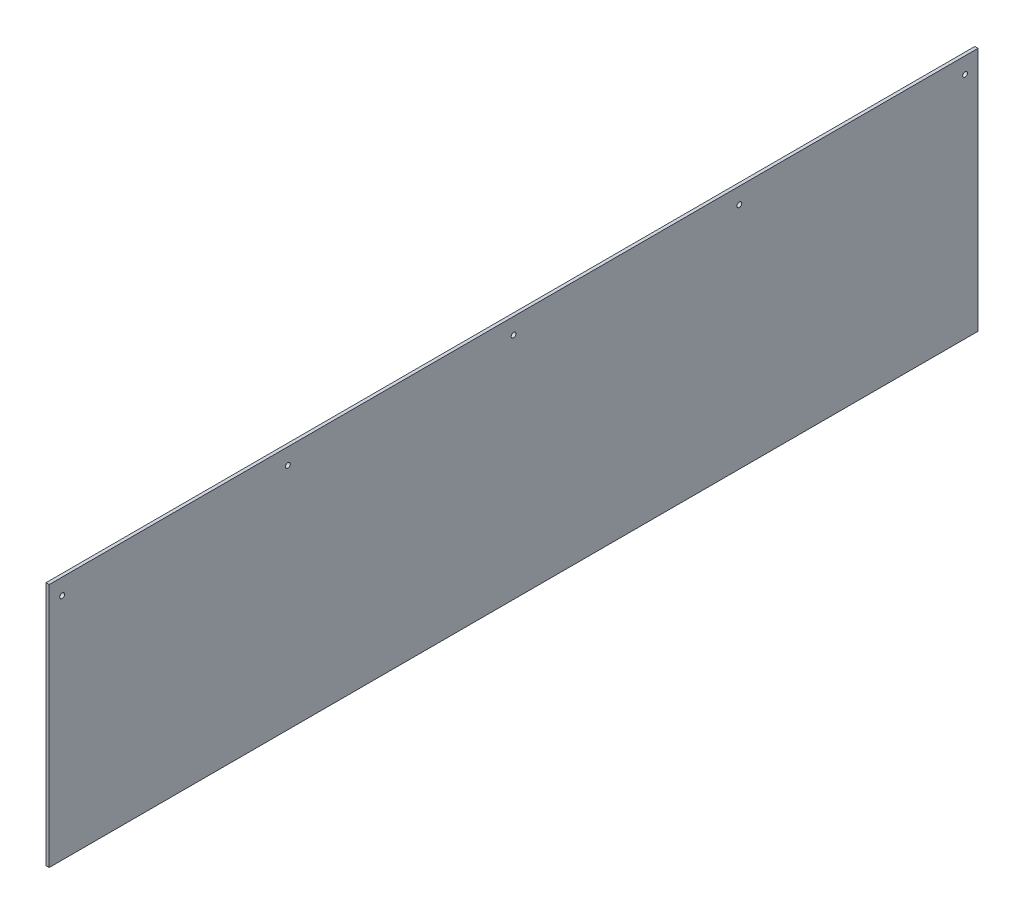
ISO-10303-21;
HEADER;
FILE_DESCRIPTION(('STEP AP214'),'2;1');
FILE_NAME('part.step','',(''),(''),'','','');
FILE_SCHEMA(('AUTOMOTIVE_DESIGN { 1 0 10303 214 1 1 1 1 }'));
ENDSEC;
DATA;
#1=APPLICATION_CONTEXT('core data for automotive mechanical design processes');
#2=APPLICATION_PROTOCOL_DEFINITION('international standard','automotive_design',2000,#1);
#3=PRODUCT_CONTEXT('',#1,'mechanical');
#4=PRODUCT('Part','Part','',(#3));
#5=PRODUCT_RELATED_PRODUCT_CATEGORY('part','',(#4));
#6=PRODUCT_DEFINITION_FORMATION('','',#4);
#7=PRODUCT_DEFINITION_CONTEXT('part definition',#1,'design');
#8=PRODUCT_DEFINITION('design','',#6,#7);
#9=PRODUCT_DEFINITION_SHAPE('','',#8);
#10=(LENGTH_UNIT() NAMED_UNIT(*) SI_UNIT(.MILLI.,.METRE.));
#11=(NAMED_UNIT(*) PLANE_ANGLE_UNIT() SI_UNIT($,.RADIAN.));
#12=(NAMED_UNIT(*) SI_UNIT($,.STERADIAN.) SOLID_ANGLE_UNIT());
#13=UNCERTAINTY_MEASURE_WITH_UNIT(LENGTH_MEASURE(1.E-05),#10,'distance_accuracy_value','');
#14=(GEOMETRIC_REPRESENTATION_CONTEXT(3) GLOBAL_UNCERTAINTY_ASSIGNED_CONTEXT((#13)) GLOBAL_UNIT_ASSIGNED_CONTEXT((#10,
#11,#12)) REPRESENTATION_CONTEXT('',''));
#15=CARTESIAN_POINT('',(0.,0.,0.));
#16=DIRECTION('',(0.,0.,1.));
#17=DIRECTION('',(1.,0.,0.));
#18=AXIS2_PLACEMENT_3D('',#15,#16,#17);
#19=CARTESIAN_POINT('',(6.35,0.,0.));
#20=DIRECTION('',(1.,0.,0.));
#21=DIRECTION('',(0.,0.,-1.));
#22=AXIS2_PLACEMENT_3D('',#19,#20,#21);
#23=PLANE('',#22);
#24=CARTESIAN_POINT('',(6.35,450.85,-1803.4));
#25=DIRECTION('',(1.,0.,0.));
#26=DIRECTION('',(0.,0.,-1.));
#27=AXIS2_PLACEMENT_3D('',#24,#25,#26);
#28=CIRCLE('',#27,4.7625);
#29=CARTESIAN_POINT('',(6.35,450.85,-1808.1625));
#30=VERTEX_POINT('',#29);
#31=EDGE_CURVE('E94',#30,#30,#28,.F.);
#32=ORIENTED_EDGE('',*,*,#31,.T.);
#33=EDGE_LOOP('',(#32));
#34=FACE_BOUND('',#33,.T.);
#35=CARTESIAN_POINT('',(6.35,450.85,-1358.9));
#36=DIRECTION('',(1.,0.,0.));
#37=DIRECTION('',(0.,0.,-1.));
#38=AXIS2_PLACEMENT_3D('',#35,#36,#37);
#39=CIRCLE('',#38,4.7625);
#40=CARTESIAN_POINT('',(6.35,450.85,-1363.6625));
#41=VERTEX_POINT('',#40);
#42=EDGE_CURVE('E97',#41,#41,#39,.F.);
#43=ORIENTED_EDGE('',*,*,#42,.T.);
#44=EDGE_LOOP('',(#43));
#45=FACE_BOUND('',#44,.T.);
#46=CARTESIAN_POINT('',(6.35,450.85,-914.4));
#47=DIRECTION('',(1.,0.,0.));
#48=DIRECTION('',(0.,0.,-1.));
#49=AXIS2_PLACEMENT_3D('',#46,#47,#48);
#50=CIRCLE('',#49,4.7625);
#51=CARTESIAN_POINT('',(6.35,450.85,-919.1625));
#52=VERTEX_POINT('',#51);
#53=EDGE_CURVE('E100',#52,#52,#50,.F.);
#54=ORIENTED_EDGE('',*,*,#53,.T.);
#55=EDGE_LOOP('',(#54));
#56=FACE_BOUND('',#55,.T.);
#57=CARTESIAN_POINT('',(6.35,450.85,-469.9));
#58=DIRECTION('',(1.,0.,0.));
#59=DIRECTION('',(0.,0.,-1.));
#60=AXIS2_PLACEMENT_3D('',#57,#58,#59);
#61=CIRCLE('',#60,4.7625);
#62=CARTESIAN_POINT('',(6.35,450.85,-474.6625));
#63=VERTEX_POINT('',#62);
#64=EDGE_CURVE('E102',#63,#63,#61,.F.);
#65=ORIENTED_EDGE('',*,*,#64,.T.);
#66=EDGE_LOOP('',(#65));
#67=FACE_BOUND('',#66,.T.);
#68=CARTESIAN_POINT('',(6.35,450.85,-25.4));
#69=DIRECTION('',(1.,0.,0.));
#70=DIRECTION('',(0.,0.,-1.));
#71=AXIS2_PLACEMENT_3D('',#68,#69,#70);
#72=CIRCLE('',#71,4.7625);
#73=CARTESIAN_POINT('',(6.35,450.85,-30.1625));
#74=VERTEX_POINT('',#73);
#75=EDGE_CURVE('E19',#74,#74,#72,.F.);
#76=ORIENTED_EDGE('',*,*,#75,.T.);
#77=EDGE_LOOP('',(#76));
#78=FACE_BOUND('',#77,.T.);
#79=DIRECTION('',(0.,1.,0.));
#80=VECTOR('',#79,1.);
#81=CARTESIAN_POINT('',(6.35,482.6,0.));
#82=LINE('',#81,#80);
#83=CARTESIAN_POINT('',(6.35,0.,0.));
#84=VERTEX_POINT('',#83);
#85=CARTESIAN_POINT('',(6.35,482.6,0.));
#86=VERTEX_POINT('',#85);
#87=EDGE_CURVE('E70',#84,#86,#82,.T.);
#88=ORIENTED_EDGE('',*,*,#87,.F.);
#89=DIRECTION('',(0.,0.,-1.));
#90=VECTOR('',#89,1.);
#91=CARTESIAN_POINT('',(6.35,0.,0.));
#92=LINE('',#91,#90);
#93=CARTESIAN_POINT('',(6.35,0.,-1828.8));
#94=VERTEX_POINT('',#93);
#95=EDGE_CURVE('E67',#94,#84,#92,.F.);
#96=ORIENTED_EDGE('',*,*,#95,.F.);
#97=DIRECTION('',(0.,1.,0.));
#98=VECTOR('',#97,1.);
#99=CARTESIAN_POINT('',(6.35,0.,-1828.8));
#100=LINE('',#99,#98);
#101=CARTESIAN_POINT('',(6.35,482.6,-1828.8));
#102=VERTEX_POINT('',#101);
#103=EDGE_CURVE('E58',#102,#94,#100,.F.);
#104=ORIENTED_EDGE('',*,*,#103,.F.);
#105=DIRECTION('',(0.,0.,1.));
#106=VECTOR('',#105,1.);
#107=CARTESIAN_POINT('',(6.35,482.6,-1828.8));
#108=LINE('',#107,#106);
#109=EDGE_CURVE('E53',#86,#102,#108,.F.);
#110=ORIENTED_EDGE('',*,*,#109,.F.);
#111=EDGE_LOOP('',(#88,#96,#104,#110));
#112=FACE_BOUND('',#111,.T.);
#113=ADVANCED_FACE('F16',(#34,#45,#56,#67,#78,#112),#23,.T.);
#114=CARTESIAN_POINT('',(0.,0.,0.));
#115=DIRECTION('',(0.,-1.,0.));
#116=DIRECTION('',(0.,0.,-1.));
#117=AXIS2_PLACEMENT_3D('',#114,#115,#116);
#118=PLANE('',#117);
#119=DIRECTION('',(1.,0.,0.));
#120=VECTOR('',#119,1.);
#121=CARTESIAN_POINT('',(0.,0.,0.));
#122=LINE('',#121,#120);
#123=CARTESIAN_POINT('',(0.,0.,0.));
#124=VERTEX_POINT('',#123);
#125=EDGE_CURVE('E110',#124,#84,#122,.T.);
#126=ORIENTED_EDGE('',*,*,#125,.F.);
#127=DIRECTION('',(0.,0.,-1.));
#128=VECTOR('',#127,1.);
#129=CARTESIAN_POINT('',(0.,0.,0.));
#130=LINE('',#129,#128);
#131=CARTESIAN_POINT('',(0.,0.,-1828.8));
#132=VERTEX_POINT('',#131);
#133=EDGE_CURVE('E77',#124,#132,#130,.T.);
#134=ORIENTED_EDGE('',*,*,#133,.T.);
#135=DIRECTION('',(-1.,0.,0.));
#136=VECTOR('',#135,1.);
#137=CARTESIAN_POINT('',(0.,0.,-1828.8));
#138=LINE('',#137,#136);
#139=EDGE_CURVE('E63',#94,#132,#138,.T.);
#140=ORIENTED_EDGE('',*,*,#139,.F.);
#141=ORIENTED_EDGE('',*,*,#95,.T.);
#142=EDGE_LOOP('',(#126,#134,#140,#141));
#143=FACE_BOUND('',#142,.T.);
#144=ADVANCED_FACE('F76',(#143),#118,.T.);
#145=CARTESIAN_POINT('',(0.,0.,-1828.8));
#146=DIRECTION('',(0.,0.,-1.));
#147=DIRECTION('',(-1.,0.,0.));
#148=AXIS2_PLACEMENT_3D('',#145,#146,#147);
#149=PLANE('',#148);
#150=ORIENTED_EDGE('',*,*,#139,.T.);
#151=DIRECTION('',(0.,1.,0.));
#152=VECTOR('',#151,1.);
#153=CARTESIAN_POINT('',(0.,0.,-1828.8));
#154=LINE('',#153,#152);
#155=CARTESIAN_POINT('',(0.,482.6,-1828.8));
#156=VERTEX_POINT('',#155);
#157=EDGE_CURVE('E121',#132,#156,#154,.T.);
#158=ORIENTED_EDGE('',*,*,#157,.T.);
#159=DIRECTION('',(1.,0.,0.));
#160=VECTOR('',#159,1.);
#161=CARTESIAN_POINT('',(0.,482.6,-1828.8));
#162=LINE('',#161,#160);
#163=EDGE_CURVE('E65',#102,#156,#162,.F.);
#164=ORIENTED_EDGE('',*,*,#163,.F.);
#165=ORIENTED_EDGE('',*,*,#103,.T.);
#166=EDGE_LOOP('',(#150,#158,#164,#165));
#167=FACE_BOUND('',#166,.T.);
#168=ADVANCED_FACE('F60',(#167),#149,.T.);
#169=CARTESIAN_POINT('',(0.,482.6,-1828.8));
#170=DIRECTION('',(0.,1.,0.));
#171=DIRECTION('',(0.,0.,1.));
#172=AXIS2_PLACEMENT_3D('',#169,#170,#171);
#173=PLANE('',#172);
#174=ORIENTED_EDGE('',*,*,#163,.T.);
#175=DIRECTION('',(0.,0.,-1.));
#176=VECTOR('',#175,1.);
#177=CARTESIAN_POINT('',(0.,482.6,0.));
#178=LINE('',#177,#176);
#179=CARTESIAN_POINT('',(0.,482.6,0.));
#180=VERTEX_POINT('',#179);
#181=EDGE_CURVE('E118',#156,#180,#178,.F.);
#182=ORIENTED_EDGE('',*,*,#181,.T.);
#183=DIRECTION('',(1.,0.,0.));
#184=VECTOR('',#183,1.);
#185=CARTESIAN_POINT('',(0.,482.6,0.));
#186=LINE('',#185,#184);
#187=EDGE_CURVE('E34',#86,#180,#186,.F.);
#188=ORIENTED_EDGE('',*,*,#187,.F.);
#189=ORIENTED_EDGE('',*,*,#109,.T.);
#190=EDGE_LOOP('',(#174,#182,#188,#189));
#191=FACE_BOUND('',#190,.T.);
#192=ADVANCED_FACE('F117',(#191),#173,.T.);
#193=CARTESIAN_POINT('',(0.,482.6,0.));
#194=DIRECTION('',(0.,0.,1.));
#195=DIRECTION('',(1.,0.,0.));
#196=AXIS2_PLACEMENT_3D('',#193,#194,#195);
#197=PLANE('',#196);
#198=ORIENTED_EDGE('',*,*,#187,.T.);
#199=DIRECTION('',(0.,1.,0.));
#200=VECTOR('',#199,1.);
#201=CARTESIAN_POINT('',(0.,0.,0.));
#202=LINE('',#201,#200);
#203=EDGE_CURVE('E93',#180,#124,#202,.F.);
#204=ORIENTED_EDGE('',*,*,#203,.T.);
#205=ORIENTED_EDGE('',*,*,#125,.T.);
#206=ORIENTED_EDGE('',*,*,#87,.T.);
#207=EDGE_LOOP('',(#198,#204,#205,#206));
#208=FACE_BOUND('',#207,.T.);
#209=ADVANCED_FACE('F124',(#208),#197,.T.);
#210=CARTESIAN_POINT('',(6.35,450.85,-25.4));
#211=DIRECTION('',(1.,0.,0.));
#212=DIRECTION('',(0.,0.,-1.));
#213=AXIS2_PLACEMENT_3D('',#210,#211,#212);
#214=CYLINDRICAL_SURFACE('',#213,4.7625);
#215=ORIENTED_EDGE('',*,*,#75,.F.);
#216=EDGE_LOOP('',(#215));
#217=FACE_BOUND('',#216,.T.);
#218=CARTESIAN_POINT('',(0.,450.85,-25.4));
#219=DIRECTION('',(1.,0.,0.));
#220=DIRECTION('',(0.,0.,-1.));
#221=AXIS2_PLACEMENT_3D('',#218,#219,#220);
#222=CIRCLE('',#221,4.7625);
#223=CARTESIAN_POINT('',(0.,450.85,-30.1625));
#224=VERTEX_POINT('',#223);
#225=EDGE_CURVE('E90',#224,#224,#222,.F.);
#226=ORIENTED_EDGE('',*,*,#225,.T.);
#227=EDGE_LOOP('',(#226));
#228=FACE_BOUND('',#227,.T.);
#229=ADVANCED_FACE('F126',(#217,#228),#214,.F.);
#230=CARTESIAN_POINT('',(6.35,450.85,-469.9));
#231=DIRECTION('',(1.,0.,0.));
#232=DIRECTION('',(0.,0.,-1.));
#233=AXIS2_PLACEMENT_3D('',#230,#231,#232);
#234=CYLINDRICAL_SURFACE('',#233,4.7625);
#235=ORIENTED_EDGE('',*,*,#64,.F.);
#236=EDGE_LOOP('',(#235));
#237=FACE_BOUND('',#236,.T.);
#238=CARTESIAN_POINT('',(0.,450.85,-469.9));
#239=DIRECTION('',(1.,0.,0.));
#240=DIRECTION('',(0.,0.,-1.));
#241=AXIS2_PLACEMENT_3D('',#238,#239,#240);
#242=CIRCLE('',#241,4.7625);
#243=CARTESIAN_POINT('',(0.,450.85,-474.6625));
#244=VERTEX_POINT('',#243);
#245=EDGE_CURVE('E87',#244,#244,#242,.F.);
#246=ORIENTED_EDGE('',*,*,#245,.T.);
#247=EDGE_LOOP('',(#246));
#248=FACE_BOUND('',#247,.T.);
#249=ADVANCED_FACE('F133',(#237,#248),#234,.F.);
#250=CARTESIAN_POINT('',(6.35,450.85,-914.4));
#251=DIRECTION('',(1.,0.,0.));
#252=DIRECTION('',(0.,0.,-1.));
#253=AXIS2_PLACEMENT_3D('',#250,#251,#252);
#254=CYLINDRICAL_SURFACE('',#253,4.7625);
#255=ORIENTED_EDGE('',*,*,#53,.F.);
#256=EDGE_LOOP('',(#255));
#257=FACE_BOUND('',#256,.T.);
#258=CARTESIAN_POINT('',(0.,450.85,-914.4));
#259=DIRECTION('',(1.,0.,0.));
#260=DIRECTION('',(0.,0.,-1.));
#261=AXIS2_PLACEMENT_3D('',#258,#259,#260);
#262=CIRCLE('',#261,4.7625);
#263=CARTESIAN_POINT('',(0.,450.85,-919.1625));
#264=VERTEX_POINT('',#263);
#265=EDGE_CURVE('E84',#264,#264,#262,.F.);
#266=ORIENTED_EDGE('',*,*,#265,.T.);
#267=EDGE_LOOP('',(#266));
#268=FACE_BOUND('',#267,.T.);
#269=ADVANCED_FACE('F152',(#257,#268),#254,.F.);
#270=CARTESIAN_POINT('',(6.35,450.85,-1358.9));
#271=DIRECTION('',(1.,0.,0.));
#272=DIRECTION('',(0.,0.,-1.));
#273=AXIS2_PLACEMENT_3D('',#270,#271,#272);
#274=CYLINDRICAL_SURFACE('',#273,4.7625);
#275=ORIENTED_EDGE('',*,*,#42,.F.);
#276=EDGE_LOOP('',(#275));
#277=FACE_BOUND('',#276,.T.);
#278=CARTESIAN_POINT('',(0.,450.85,-1358.9));
#279=DIRECTION('',(1.,0.,0.));
#280=DIRECTION('',(0.,0.,-1.));
#281=AXIS2_PLACEMENT_3D('',#278,#279,#280);
#282=CIRCLE('',#281,4.7625);
#283=CARTESIAN_POINT('',(0.,450.85,-1363.6625));
#284=VERTEX_POINT('',#283);
#285=EDGE_CURVE('E25',#284,#284,#282,.F.);
#286=ORIENTED_EDGE('',*,*,#285,.T.);
#287=EDGE_LOOP('',(#286));
#288=FACE_BOUND('',#287,.T.);
#289=ADVANCED_FACE('F144',(#277,#288),#274,.F.);
#290=CARTESIAN_POINT('',(6.35,450.85,-1803.4));
#291=DIRECTION('',(1.,0.,0.));
#292=DIRECTION('',(0.,0.,-1.));
#293=AXIS2_PLACEMENT_3D('',#290,#291,#292);
#294=CYLINDRICAL_SURFACE('',#293,4.7625);
#295=ORIENTED_EDGE('',*,*,#31,.F.);
#296=EDGE_LOOP('',(#295));
#297=FACE_BOUND('',#296,.T.);
#298=CARTESIAN_POINT('',(0.,450.85,-1803.4));
#299=DIRECTION('',(1.,0.,0.));
#300=DIRECTION('',(0.,0.,-1.));
#301=AXIS2_PLACEMENT_3D('',#298,#299,#300);
#302=CIRCLE('',#301,4.7625);
#303=CARTESIAN_POINT('',(0.,450.85,-1808.1625));
#304=VERTEX_POINT('',#303);
#305=EDGE_CURVE('E11',#304,#304,#302,.F.);
#306=ORIENTED_EDGE('',*,*,#305,.T.);
#307=EDGE_LOOP('',(#306));
#308=FACE_BOUND('',#307,.T.);
#309=ADVANCED_FACE('F138',(#297,#308),#294,.F.);
#310=CARTESIAN_POINT('',(0.,0.,0.));
#311=DIRECTION('',(1.,0.,0.));
#312=DIRECTION('',(0.,0.,-1.));
#313=AXIS2_PLACEMENT_3D('',#310,#311,#312);
#314=PLANE('',#313);
#315=ORIENTED_EDGE('',*,*,#305,.F.);
#316=EDGE_LOOP('',(#315));
#317=FACE_BOUND('',#316,.T.);
#318=ORIENTED_EDGE('',*,*,#285,.F.);
#319=EDGE_LOOP('',(#318));
#320=FACE_BOUND('',#319,.T.);
#321=ORIENTED_EDGE('',*,*,#265,.F.);
#322=EDGE_LOOP('',(#321));
#323=FACE_BOUND('',#322,.T.);
#324=ORIENTED_EDGE('',*,*,#245,.F.);
#325=EDGE_LOOP('',(#324));
#326=FACE_BOUND('',#325,.T.);
#327=ORIENTED_EDGE('',*,*,#225,.F.);
#328=EDGE_LOOP('',(#327));
#329=FACE_BOUND('',#328,.T.);
#330=ORIENTED_EDGE('',*,*,#181,.F.);
#331=ORIENTED_EDGE('',*,*,#157,.F.);
#332=ORIENTED_EDGE('',*,*,#133,.F.);
#333=ORIENTED_EDGE('',*,*,#203,.F.);
#334=EDGE_LOOP('',(#330,#331,#332,#333));
#335=FACE_BOUND('',#334,.T.);
#336=ADVANCED_FACE('F120',(#317,#320,#323,#326,#329,#335),#314,.F.);
#337=CLOSED_SHELL('',(#113,#144,#168,#192,#209,#229,#249,#269,#289,#309,#336));
#338=MANIFOLD_SOLID_BREP('B1',#337);
#339=ADVANCED_BREP_SHAPE_REPRESENTATION('',(#18,#338),#14);
#340=SHAPE_DEFINITION_REPRESENTATION(#9,#339);
ENDSEC;
END-ISO-10303-21;
